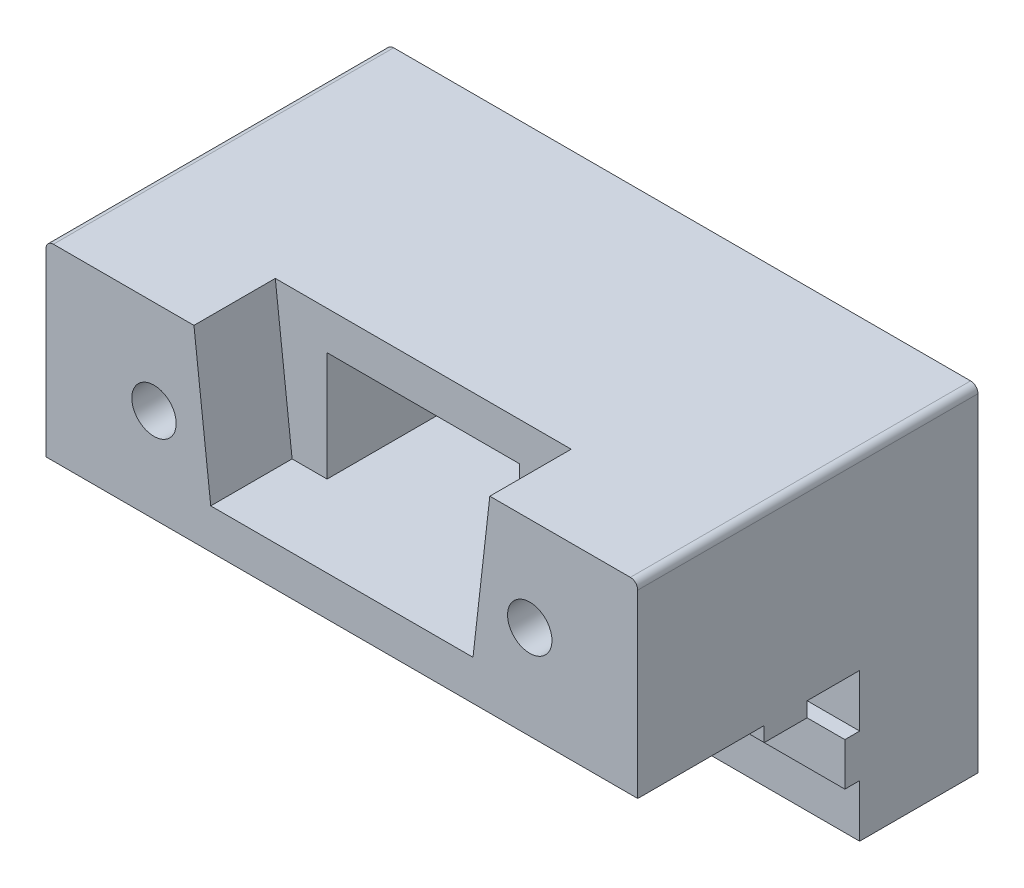
ISO-10303-21;
HEADER;
FILE_DESCRIPTION(('STEP AP214'),'2;1');
FILE_NAME('part.step','',(''),(''),'','','');
FILE_SCHEMA(('AUTOMOTIVE_DESIGN { 1 0 10303 214 1 1 1 1 }'));
ENDSEC;
DATA;
#1=APPLICATION_CONTEXT('core data for automotive mechanical design processes');
#2=APPLICATION_PROTOCOL_DEFINITION('international standard','automotive_design',2000,#1);
#3=PRODUCT_CONTEXT('',#1,'mechanical');
#4=PRODUCT('Part','Part','',(#3));
#5=PRODUCT_RELATED_PRODUCT_CATEGORY('part','',(#4));
#6=PRODUCT_DEFINITION_FORMATION('','',#4);
#7=PRODUCT_DEFINITION_CONTEXT('part definition',#1,'design');
#8=PRODUCT_DEFINITION('design','',#6,#7);
#9=PRODUCT_DEFINITION_SHAPE('','',#8);
#10=(LENGTH_UNIT() NAMED_UNIT(*) SI_UNIT(.MILLI.,.METRE.));
#11=(NAMED_UNIT(*) PLANE_ANGLE_UNIT() SI_UNIT($,.RADIAN.));
#12=(NAMED_UNIT(*) SI_UNIT($,.STERADIAN.) SOLID_ANGLE_UNIT());
#13=UNCERTAINTY_MEASURE_WITH_UNIT(LENGTH_MEASURE(1.E-05),#10,'distance_accuracy_value','');
#14=(GEOMETRIC_REPRESENTATION_CONTEXT(3) GLOBAL_UNCERTAINTY_ASSIGNED_CONTEXT((#13)) GLOBAL_UNIT_ASSIGNED_CONTEXT((#10,
#11,#12)) REPRESENTATION_CONTEXT('',''));
#15=CARTESIAN_POINT('',(0.,0.,0.));
#16=DIRECTION('',(0.,0.,1.));
#17=DIRECTION('',(1.,0.,0.));
#18=AXIS2_PLACEMENT_3D('',#15,#16,#17);
#19=CARTESIAN_POINT('',(46.2733705489037,-9.9,8.));
#20=DIRECTION('',(0.,1.,0.));
#21=DIRECTION('',(0.,0.,1.));
#22=AXIS2_PLACEMENT_3D('',#19,#20,#21);
#23=PLANE('',#22);
#24=DIRECTION('',(0.,0.,-1.));
#25=VECTOR('',#24,1.);
#26=CARTESIAN_POINT('',(0.384057287393444,-9.9,23.));
#27=LINE('',#26,#25);
#28=CARTESIAN_POINT('',(0.384057287393444,-9.9,9.));
#29=VERTEX_POINT('',#28);
#30=CARTESIAN_POINT('',(0.384057287393444,-9.9,8.));
#31=VERTEX_POINT('',#30);
#32=EDGE_CURVE('E240',#29,#31,#27,.T.);
#33=ORIENTED_EDGE('',*,*,#32,.F.);
#34=DIRECTION('',(-1.,0.,0.));
#35=VECTOR('',#34,1.);
#36=CARTESIAN_POINT('',(46.2733705489037,-9.9,9.));
#37=LINE('',#36,#35);
#38=CARTESIAN_POINT('',(20.,-9.9,9.));
#39=VERTEX_POINT('',#38);
#40=EDGE_CURVE('E239',#39,#29,#37,.T.);
#41=ORIENTED_EDGE('',*,*,#40,.F.);
#42=DIRECTION('',(0.,0.,1.));
#43=VECTOR('',#42,1.);
#44=CARTESIAN_POINT('',(20.,-9.9,8.));
#45=LINE('',#44,#43);
#46=CARTESIAN_POINT('',(20.,-9.9,8.));
#47=VERTEX_POINT('',#46);
#48=EDGE_CURVE('E378',#47,#39,#45,.T.);
#49=ORIENTED_EDGE('',*,*,#48,.F.);
#50=DIRECTION('',(-1.,0.,0.));
#51=VECTOR('',#50,1.);
#52=CARTESIAN_POINT('',(46.2733705489037,-9.9,8.));
#53=LINE('',#52,#51);
#54=EDGE_CURVE('E433',#47,#31,#53,.T.);
#55=ORIENTED_EDGE('',*,*,#54,.T.);
#56=EDGE_LOOP('',(#33,#41,#49,#55));
#57=FACE_BOUND('',#56,.T.);
#58=ADVANCED_FACE('F34',(#57),#23,.T.);
#59=CARTESIAN_POINT('',(46.2733705489037,-9.9,9.));
#60=DIRECTION('',(0.,0.,1.));
#61=DIRECTION('',(1.,0.,0.));
#62=AXIS2_PLACEMENT_3D('',#59,#60,#61);
#63=PLANE('',#62);
#64=CARTESIAN_POINT('',(0.,-11.35,9.));
#65=DIRECTION('',(0.,0.,1.));
#66=DIRECTION('',(1.,0.,0.));
#67=AXIS2_PLACEMENT_3D('',#64,#65,#66);
#68=CIRCLE('',#67,1.5);
#69=CARTESIAN_POINT('',(-0.384057287393444,-9.9,9.));
#70=VERTEX_POINT('',#69);
#71=CARTESIAN_POINT('',(-0.384057287393418,-12.8,9.));
#72=VERTEX_POINT('',#71);
#73=EDGE_CURVE('E242',#70,#72,#68,.T.);
#74=ORIENTED_EDGE('',*,*,#73,.F.);
#75=CARTESIAN_POINT('',(-20.,-9.9,9.));
#76=VERTEX_POINT('',#75);
#77=EDGE_CURVE('E245',#70,#76,#37,.T.);
#78=ORIENTED_EDGE('',*,*,#77,.T.);
#79=DIRECTION('',(0.,1.,0.));
#80=VECTOR('',#79,1.);
#81=CARTESIAN_POINT('',(-20.,-9.9,9.));
#82=LINE('',#81,#80);
#83=CARTESIAN_POINT('',(-20.,-12.8,9.));
#84=VERTEX_POINT('',#83);
#85=EDGE_CURVE('E395',#84,#76,#82,.T.);
#86=ORIENTED_EDGE('',*,*,#85,.F.);
#87=DIRECTION('',(-1.,0.,0.));
#88=VECTOR('',#87,1.);
#89=CARTESIAN_POINT('',(46.2733705489037,-12.8,9.));
#90=LINE('',#89,#88);
#91=EDGE_CURVE('E246',#72,#84,#90,.T.);
#92=ORIENTED_EDGE('',*,*,#91,.F.);
#93=EDGE_LOOP('',(#74,#78,#86,#92));
#94=FACE_BOUND('',#93,.T.);
#95=ADVANCED_FACE('F460',(#94),#63,.T.);
#96=CARTESIAN_POINT('',(46.2733705489037,-12.8,9.));
#97=DIRECTION('',(0.,-1.,0.));
#98=DIRECTION('',(0.,0.,-1.));
#99=AXIS2_PLACEMENT_3D('',#96,#97,#98);
#100=PLANE('',#99);
#101=DIRECTION('',(0.,0.,-1.));
#102=VECTOR('',#101,1.);
#103=CARTESIAN_POINT('',(-0.384057287393418,-12.8,23.));
#104=LINE('',#103,#102);
#105=CARTESIAN_POINT('',(-0.384057287393418,-12.8,8.));
#106=VERTEX_POINT('',#105);
#107=EDGE_CURVE('E462',#72,#106,#104,.T.);
#108=ORIENTED_EDGE('',*,*,#107,.F.);
#109=ORIENTED_EDGE('',*,*,#91,.T.);
#110=DIRECTION('',(0.,0.,1.));
#111=VECTOR('',#110,1.);
#112=CARTESIAN_POINT('',(-20.,-12.8,9.));
#113=LINE('',#112,#111);
#114=CARTESIAN_POINT('',(-20.,-12.8,8.));
#115=VERTEX_POINT('',#114);
#116=EDGE_CURVE('E363',#115,#84,#113,.T.);
#117=ORIENTED_EDGE('',*,*,#116,.F.);
#118=DIRECTION('',(-1.,0.,0.));
#119=VECTOR('',#118,1.);
#120=CARTESIAN_POINT('',(46.2733705489037,-12.8,8.));
#121=LINE('',#120,#119);
#122=EDGE_CURVE('E253',#106,#115,#121,.T.);
#123=ORIENTED_EDGE('',*,*,#122,.F.);
#124=EDGE_LOOP('',(#108,#109,#117,#123));
#125=FACE_BOUND('',#124,.T.);
#126=ADVANCED_FACE('F553',(#125),#100,.T.);
#127=CARTESIAN_POINT('',(-12.7,0.,0.));
#128=DIRECTION('',(0.,0.,1.));
#129=DIRECTION('',(1.,0.,0.));
#130=AXIS2_PLACEMENT_3D('',#127,#128,#129);
#131=CYLINDRICAL_SURFACE('',#130,1.5);
#132=CARTESIAN_POINT('',(-12.7,0.,23.));
#133=DIRECTION('',(0.,0.,1.));
#134=DIRECTION('',(1.,0.,0.));
#135=AXIS2_PLACEMENT_3D('',#132,#133,#134);
#136=CIRCLE('',#135,1.5);
#137=CARTESIAN_POINT('',(-11.2,0.,23.));
#138=VERTEX_POINT('',#137);
#139=EDGE_CURVE('E307',#138,#138,#136,.T.);
#140=ORIENTED_EDGE('',*,*,#139,.T.);
#141=EDGE_LOOP('',(#140));
#142=FACE_BOUND('',#141,.T.);
#143=CARTESIAN_POINT('',(-12.7,0.,13.));
#144=DIRECTION('',(0.,0.,-1.));
#145=DIRECTION('',(-1.,0.,0.));
#146=AXIS2_PLACEMENT_3D('',#143,#144,#145);
#147=CIRCLE('',#146,1.5);
#148=CARTESIAN_POINT('',(-14.2,0.,13.));
#149=VERTEX_POINT('',#148);
#150=EDGE_CURVE('E38',#149,#149,#147,.F.);
#151=ORIENTED_EDGE('',*,*,#150,.F.);
#152=EDGE_LOOP('',(#151));
#153=FACE_BOUND('',#152,.T.);
#154=ADVANCED_FACE('F666',(#142,#153),#131,.F.);
#155=CARTESIAN_POINT('',(12.7,0.,0.));
#156=DIRECTION('',(0.,0.,1.));
#157=DIRECTION('',(1.,0.,0.));
#158=AXIS2_PLACEMENT_3D('',#155,#156,#157);
#159=CYLINDRICAL_SURFACE('',#158,1.5);
#160=CARTESIAN_POINT('',(12.7,0.,23.));
#161=DIRECTION('',(0.,0.,1.));
#162=DIRECTION('',(1.,0.,0.));
#163=AXIS2_PLACEMENT_3D('',#160,#161,#162);
#164=CIRCLE('',#163,1.5);
#165=CARTESIAN_POINT('',(14.2,0.,23.));
#166=VERTEX_POINT('',#165);
#167=EDGE_CURVE('E294',#166,#166,#164,.T.);
#168=ORIENTED_EDGE('',*,*,#167,.T.);
#169=EDGE_LOOP('',(#168));
#170=FACE_BOUND('',#169,.T.);
#171=CARTESIAN_POINT('',(12.7,0.,13.));
#172=DIRECTION('',(0.,0.,-1.));
#173=DIRECTION('',(-1.,0.,0.));
#174=AXIS2_PLACEMENT_3D('',#171,#172,#173);
#175=CIRCLE('',#174,1.5);
#176=CARTESIAN_POINT('',(11.2,0.,13.));
#177=VERTEX_POINT('',#176);
#178=EDGE_CURVE('E356',#177,#177,#175,.F.);
#179=ORIENTED_EDGE('',*,*,#178,.F.);
#180=EDGE_LOOP('',(#179));
#181=FACE_BOUND('',#180,.T.);
#182=ADVANCED_FACE('F686',(#170,#181),#159,.F.);
#183=CARTESIAN_POINT('',(-20.,-6.35,23.));
#184=DIRECTION('',(0.,1.,0.));
#185=DIRECTION('',(-1.,0.,0.));
#186=AXIS2_PLACEMENT_3D('',#183,#184,#185);
#187=PLANE('',#186);
#188=DIRECTION('',(0.,0.,-1.));
#189=VECTOR('',#188,1.);
#190=CARTESIAN_POINT('',(-20.,-6.35,23.));
#191=LINE('',#190,#189);
#192=CARTESIAN_POINT('',(-20.,-6.35,23.));
#193=VERTEX_POINT('',#192);
#194=CARTESIAN_POINT('',(-20.,-6.35,14.45));
#195=VERTEX_POINT('',#194);
#196=EDGE_CURVE('E332',#193,#195,#191,.T.);
#197=ORIENTED_EDGE('',*,*,#196,.T.);
#198=DIRECTION('',(-1.,0.,0.));
#199=VECTOR('',#198,1.);
#200=CARTESIAN_POINT('',(46.2733705489037,-6.35,14.45));
#201=LINE('',#200,#199);
#202=CARTESIAN_POINT('',(20.,-6.35,14.45));
#203=VERTEX_POINT('',#202);
#204=EDGE_CURVE('E425',#203,#195,#201,.T.);
#205=ORIENTED_EDGE('',*,*,#204,.F.);
#206=DIRECTION('',(0.,0.,-1.));
#207=VECTOR('',#206,1.);
#208=CARTESIAN_POINT('',(20.,-6.35,23.));
#209=LINE('',#208,#207);
#210=CARTESIAN_POINT('',(20.,-6.35,23.));
#211=VERTEX_POINT('',#210);
#212=EDGE_CURVE('E328',#211,#203,#209,.T.);
#213=ORIENTED_EDGE('',*,*,#212,.F.);
#214=DIRECTION('',(1.,0.,0.));
#215=VECTOR('',#214,1.);
#216=CARTESIAN_POINT('',(-20.,-6.35,23.));
#217=LINE('',#216,#215);
#218=EDGE_CURVE('E313',#193,#211,#217,.T.);
#219=ORIENTED_EDGE('',*,*,#218,.F.);
#220=EDGE_LOOP('',(#197,#205,#213,#219));
#221=FACE_BOUND('',#220,.T.);
#222=ADVANCED_FACE('F533',(#221),#187,.F.);
#223=CARTESIAN_POINT('',(20.,-6.35,11.55));
#224=VERTEX_POINT('',#223);
#225=CARTESIAN_POINT('',(20.,-6.35,8.));
#226=VERTEX_POINT('',#225);
#227=EDGE_CURVE('E322',#224,#226,#209,.T.);
#228=ORIENTED_EDGE('',*,*,#227,.F.);
#229=DIRECTION('',(-1.,0.,0.));
#230=VECTOR('',#229,1.);
#231=CARTESIAN_POINT('',(46.2733705489037,-6.35,11.55));
#232=LINE('',#231,#230);
#233=CARTESIAN_POINT('',(-20.,-6.35,11.55));
#234=VERTEX_POINT('',#233);
#235=EDGE_CURVE('E59',#224,#234,#232,.T.);
#236=ORIENTED_EDGE('',*,*,#235,.T.);
#237=CARTESIAN_POINT('',(-20.,-6.35,8.));
#238=VERTEX_POINT('',#237);
#239=EDGE_CURVE('E331',#234,#238,#191,.T.);
#240=ORIENTED_EDGE('',*,*,#239,.T.);
#241=DIRECTION('',(-1.,0.,0.));
#242=VECTOR('',#241,1.);
#243=CARTESIAN_POINT('',(46.2733705489037,-6.35,8.));
#244=LINE('',#243,#242);
#245=EDGE_CURVE('E432',#226,#238,#244,.T.);
#246=ORIENTED_EDGE('',*,*,#245,.F.);
#247=EDGE_LOOP('',(#228,#236,#240,#246));
#248=FACE_BOUND('',#247,.T.);
#249=ADVANCED_FACE('F546',(#248),#187,.F.);
#250=CARTESIAN_POINT('',(-20.,6.35,23.));
#251=DIRECTION('',(0.,-1.,0.));
#252=DIRECTION('',(1.,0.,0.));
#253=AXIS2_PLACEMENT_3D('',#250,#251,#252);
#254=PLANE('',#253);
#255=DIRECTION('',(0.,0.,1.));
#256=VECTOR('',#255,1.);
#257=CARTESIAN_POINT('',(-10.,6.35,-6.46330528120025));
#258=LINE('',#257,#256);
#259=CARTESIAN_POINT('',(-10.,6.35,17.5));
#260=VERTEX_POINT('',#259);
#261=CARTESIAN_POINT('',(-10.,6.35,23.));
#262=VERTEX_POINT('',#261);
#263=EDGE_CURVE('E300',#260,#262,#258,.T.);
#264=ORIENTED_EDGE('',*,*,#263,.F.);
#265=DIRECTION('',(-1.,0.,0.));
#266=VECTOR('',#265,1.);
#267=CARTESIAN_POINT('',(10.,6.35,17.5));
#268=LINE('',#267,#266);
#269=CARTESIAN_POINT('',(10.,6.35,17.5));
#270=VERTEX_POINT('',#269);
#271=EDGE_CURVE('E292',#270,#260,#268,.T.);
#272=ORIENTED_EDGE('',*,*,#271,.F.);
#273=DIRECTION('',(0.,0.,1.));
#274=VECTOR('',#273,1.);
#275=CARTESIAN_POINT('',(10.,6.35,-6.46330528120025));
#276=LINE('',#275,#274);
#277=CARTESIAN_POINT('',(10.,6.35,23.));
#278=VERTEX_POINT('',#277);
#279=EDGE_CURVE('E297',#270,#278,#276,.T.);
#280=ORIENTED_EDGE('',*,*,#279,.T.);
#281=DIRECTION('',(-1.,0.,0.));
#282=VECTOR('',#281,1.);
#283=CARTESIAN_POINT('',(-20.,6.35,23.));
#284=LINE('',#283,#282);
#285=CARTESIAN_POINT('',(19.5,6.35,23.));
#286=VERTEX_POINT('',#285);
#287=EDGE_CURVE('E319',#286,#278,#284,.T.);
#288=ORIENTED_EDGE('',*,*,#287,.F.);
#289=DIRECTION('',(0.,0.,-1.));
#290=VECTOR('',#289,1.);
#291=CARTESIAN_POINT('',(19.5,6.35,23.));
#292=LINE('',#291,#290);
#293=CARTESIAN_POINT('',(19.5,6.35,0.));
#294=VERTEX_POINT('',#293);
#295=EDGE_CURVE('E338',#286,#294,#292,.T.);
#296=ORIENTED_EDGE('',*,*,#295,.T.);
#297=DIRECTION('',(-1.,0.,0.));
#298=VECTOR('',#297,1.);
#299=CARTESIAN_POINT('',(-20.,6.35,0.));
#300=LINE('',#299,#298);
#301=CARTESIAN_POINT('',(-19.5,6.35,0.));
#302=VERTEX_POINT('',#301);
#303=EDGE_CURVE('E314',#294,#302,#300,.T.);
#304=ORIENTED_EDGE('',*,*,#303,.T.);
#305=DIRECTION('',(0.,0.,-1.));
#306=VECTOR('',#305,1.);
#307=CARTESIAN_POINT('',(-19.5,6.35,23.));
#308=LINE('',#307,#306);
#309=CARTESIAN_POINT('',(-19.5,6.35,23.));
#310=VERTEX_POINT('',#309);
#311=EDGE_CURVE('E335',#302,#310,#308,.F.);
#312=ORIENTED_EDGE('',*,*,#311,.T.);
#313=EDGE_CURVE('E318',#262,#310,#284,.T.);
#314=ORIENTED_EDGE('',*,*,#313,.F.);
#315=EDGE_LOOP('',(#264,#272,#280,#288,#296,#304,#312,#314));
#316=FACE_BOUND('',#315,.T.);
#317=ADVANCED_FACE('F522',(#316),#254,.F.);
#318=CARTESIAN_POINT('',(0.,0.,23.));
#319=DIRECTION('',(0.,0.,1.));
#320=DIRECTION('',(1.,0.,0.));
#321=AXIS2_PLACEMENT_3D('',#318,#319,#320);
#322=PLANE('',#321);
#323=DIRECTION('',(-0.112909688044286,-0.993605254789719,0.));
#324=VECTOR('',#323,1.);
#325=CARTESIAN_POINT('',(8.5,-6.85,23.));
#326=LINE('',#325,#324);
#327=CARTESIAN_POINT('',(8.86363636363637,-3.65,23.));
#328=VERTEX_POINT('',#327);
#329=EDGE_CURVE('E285',#278,#328,#326,.T.);
#330=ORIENTED_EDGE('',*,*,#329,.T.);
#331=DIRECTION('',(-1.,0.,0.));
#332=VECTOR('',#331,1.);
#333=CARTESIAN_POINT('',(46.2733705489037,-3.65,23.));
#334=LINE('',#333,#332);
#335=CARTESIAN_POINT('',(-8.86363636363635,-3.65,23.));
#336=VERTEX_POINT('',#335);
#337=EDGE_CURVE('E422',#328,#336,#334,.T.);
#338=ORIENTED_EDGE('',*,*,#337,.T.);
#339=DIRECTION('',(-0.112909688044286,0.993605254789719,0.));
#340=VECTOR('',#339,1.);
#341=CARTESIAN_POINT('',(-9.16012238653748,-1.04092299847017,23.));
#342=LINE('',#341,#340);
#343=EDGE_CURVE('E43',#336,#262,#342,.T.);
#344=ORIENTED_EDGE('',*,*,#343,.T.);
#345=ORIENTED_EDGE('',*,*,#313,.T.);
#346=CARTESIAN_POINT('',(-19.5,5.85,23.));
#347=DIRECTION('',(0.,0.,1.));
#348=DIRECTION('',(1.,0.,0.));
#349=AXIS2_PLACEMENT_3D('',#346,#347,#348);
#350=CIRCLE('',#349,0.5);
#351=CARTESIAN_POINT('',(-20.,5.85,23.));
#352=VERTEX_POINT('',#351);
#353=EDGE_CURVE('E349',#310,#352,#350,.T.);
#354=ORIENTED_EDGE('',*,*,#353,.T.);
#355=DIRECTION('',(0.,-1.,0.));
#356=VECTOR('',#355,1.);
#357=CARTESIAN_POINT('',(-20.,6.35,23.));
#358=LINE('',#357,#356);
#359=EDGE_CURVE('E311',#352,#193,#358,.T.);
#360=ORIENTED_EDGE('',*,*,#359,.T.);
#361=ORIENTED_EDGE('',*,*,#218,.T.);
#362=DIRECTION('',(0.,1.,0.));
#363=VECTOR('',#362,1.);
#364=CARTESIAN_POINT('',(20.,6.35,23.));
#365=LINE('',#364,#363);
#366=CARTESIAN_POINT('',(20.,5.85,23.));
#367=VERTEX_POINT('',#366);
#368=EDGE_CURVE('E316',#211,#367,#365,.T.);
#369=ORIENTED_EDGE('',*,*,#368,.T.);
#370=CARTESIAN_POINT('',(19.5,5.85,23.));
#371=DIRECTION('',(0.,0.,1.));
#372=DIRECTION('',(1.,0.,0.));
#373=AXIS2_PLACEMENT_3D('',#370,#371,#372);
#374=CIRCLE('',#373,0.5);
#375=EDGE_CURVE('E351',#367,#286,#374,.T.);
#376=ORIENTED_EDGE('',*,*,#375,.T.);
#377=ORIENTED_EDGE('',*,*,#287,.T.);
#378=EDGE_LOOP('',(#330,#338,#344,#345,#354,#360,#361,#369,#376,#377));
#379=FACE_BOUND('',#378,.T.);
#380=ORIENTED_EDGE('',*,*,#167,.F.);
#381=EDGE_LOOP('',(#380));
#382=FACE_BOUND('',#381,.T.);
#383=ORIENTED_EDGE('',*,*,#139,.F.);
#384=EDGE_LOOP('',(#383));
#385=FACE_BOUND('',#384,.T.);
#386=ADVANCED_FACE('F527',(#379,#382,#385),#322,.T.);
#387=CARTESIAN_POINT('',(-20.,6.35,23.));
#388=DIRECTION('',(1.,0.,0.));
#389=DIRECTION('',(0.,0.,-1.));
#390=AXIS2_PLACEMENT_3D('',#387,#388,#389);
#391=PLANE('',#390);
#392=DIRECTION('',(0.,-1.,0.));
#393=VECTOR('',#392,1.);
#394=CARTESIAN_POINT('',(-20.,6.35,0.));
#395=LINE('',#394,#393);
#396=CARTESIAN_POINT('',(-20.,5.85,0.));
#397=VERTEX_POINT('',#396);
#398=CARTESIAN_POINT('',(-20.,-16.35,0.));
#399=VERTEX_POINT('',#398);
#400=EDGE_CURVE('E310',#397,#399,#395,.T.);
#401=ORIENTED_EDGE('',*,*,#400,.T.);
#402=DIRECTION('',(0.,0.,1.));
#403=VECTOR('',#402,1.);
#404=CARTESIAN_POINT('',(-20.,-16.35,8.));
#405=LINE('',#404,#403);
#406=CARTESIAN_POINT('',(-20.,-16.35,8.));
#407=VERTEX_POINT('',#406);
#408=EDGE_CURVE('E413',#399,#407,#405,.T.);
#409=ORIENTED_EDGE('',*,*,#408,.T.);
#410=DIRECTION('',(0.,1.,0.));
#411=VECTOR('',#410,1.);
#412=CARTESIAN_POINT('',(-20.,-12.8,8.));
#413=LINE('',#412,#411);
#414=EDGE_CURVE('E358',#407,#115,#413,.T.);
#415=ORIENTED_EDGE('',*,*,#414,.T.);
#416=ORIENTED_EDGE('',*,*,#116,.T.);
#417=ORIENTED_EDGE('',*,*,#85,.T.);
#418=DIRECTION('',(0.,0.,-1.));
#419=VECTOR('',#418,1.);
#420=CARTESIAN_POINT('',(-20.,-9.9,8.));
#421=LINE('',#420,#419);
#422=CARTESIAN_POINT('',(-20.,-9.9,8.));
#423=VERTEX_POINT('',#422);
#424=EDGE_CURVE('E398',#76,#423,#421,.T.);
#425=ORIENTED_EDGE('',*,*,#424,.T.);
#426=DIRECTION('',(0.,1.,0.));
#427=VECTOR('',#426,1.);
#428=CARTESIAN_POINT('',(-20.,-6.35,8.));
#429=LINE('',#428,#427);
#430=EDGE_CURVE('E401',#423,#238,#429,.T.);
#431=ORIENTED_EDGE('',*,*,#430,.T.);
#432=ORIENTED_EDGE('',*,*,#239,.F.);
#433=DIRECTION('',(0.,-1.,0.));
#434=VECTOR('',#433,1.);
#435=CARTESIAN_POINT('',(-20.,-7.35,11.55));
#436=LINE('',#435,#434);
#437=CARTESIAN_POINT('',(-20.,-7.35,11.55));
#438=VERTEX_POINT('',#437);
#439=EDGE_CURVE('E404',#234,#438,#436,.T.);
#440=ORIENTED_EDGE('',*,*,#439,.T.);
#441=DIRECTION('',(0.,0.,1.));
#442=VECTOR('',#441,1.);
#443=CARTESIAN_POINT('',(-20.,-7.35,14.45));
#444=LINE('',#443,#442);
#445=CARTESIAN_POINT('',(-20.,-7.35,14.45));
#446=VERTEX_POINT('',#445);
#447=EDGE_CURVE('E407',#438,#446,#444,.T.);
#448=ORIENTED_EDGE('',*,*,#447,.T.);
#449=DIRECTION('',(0.,1.,0.));
#450=VECTOR('',#449,1.);
#451=CARTESIAN_POINT('',(-20.,-6.35,14.45));
#452=LINE('',#451,#450);
#453=EDGE_CURVE('E410',#446,#195,#452,.T.);
#454=ORIENTED_EDGE('',*,*,#453,.T.);
#455=ORIENTED_EDGE('',*,*,#196,.F.);
#456=ORIENTED_EDGE('',*,*,#359,.F.);
#457=DIRECTION('',(0.,0.,-1.));
#458=VECTOR('',#457,1.);
#459=CARTESIAN_POINT('',(-20.,5.85,23.));
#460=LINE('',#459,#458);
#461=EDGE_CURVE('E353',#352,#397,#460,.T.);
#462=ORIENTED_EDGE('',*,*,#461,.T.);
#463=EDGE_LOOP('',(#401,#409,#415,#416,#417,#425,#431,#432,#440,#448,#454,#455,#456,#462));
#464=FACE_BOUND('',#463,.T.);
#465=ADVANCED_FACE('F454',(#464),#391,.F.);
#466=CARTESIAN_POINT('',(20.,6.35,23.));
#467=DIRECTION('',(-1.,0.,0.));
#468=DIRECTION('',(0.,0.,1.));
#469=AXIS2_PLACEMENT_3D('',#466,#467,#468);
#470=PLANE('',#469);
#471=DIRECTION('',(0.,0.,-1.));
#472=VECTOR('',#471,1.);
#473=CARTESIAN_POINT('',(20.,5.85,23.));
#474=LINE('',#473,#472);
#475=CARTESIAN_POINT('',(20.,5.85,0.));
#476=VERTEX_POINT('',#475);
#477=EDGE_CURVE('E346',#476,#367,#474,.F.);
#478=ORIENTED_EDGE('',*,*,#477,.T.);
#479=ORIENTED_EDGE('',*,*,#368,.F.);
#480=ORIENTED_EDGE('',*,*,#212,.T.);
#481=DIRECTION('',(0.,-1.,0.));
#482=VECTOR('',#481,1.);
#483=CARTESIAN_POINT('',(20.,-6.35,14.45));
#484=LINE('',#483,#482);
#485=CARTESIAN_POINT('',(20.,-7.35,14.45));
#486=VERTEX_POINT('',#485);
#487=EDGE_CURVE('E387',#203,#486,#484,.T.);
#488=ORIENTED_EDGE('',*,*,#487,.T.);
#489=DIRECTION('',(0.,0.,-1.));
#490=VECTOR('',#489,1.);
#491=CARTESIAN_POINT('',(20.,-7.35,14.45));
#492=LINE('',#491,#490);
#493=CARTESIAN_POINT('',(20.,-7.35,11.55));
#494=VERTEX_POINT('',#493);
#495=EDGE_CURVE('E385',#486,#494,#492,.T.);
#496=ORIENTED_EDGE('',*,*,#495,.T.);
#497=DIRECTION('',(0.,1.,0.));
#498=VECTOR('',#497,1.);
#499=CARTESIAN_POINT('',(20.,-7.35,11.55));
#500=LINE('',#499,#498);
#501=EDGE_CURVE('E383',#494,#224,#500,.T.);
#502=ORIENTED_EDGE('',*,*,#501,.T.);
#503=ORIENTED_EDGE('',*,*,#227,.T.);
#504=DIRECTION('',(0.,-1.,0.));
#505=VECTOR('',#504,1.);
#506=CARTESIAN_POINT('',(20.,-6.35,8.));
#507=LINE('',#506,#505);
#508=EDGE_CURVE('E381',#226,#47,#507,.T.);
#509=ORIENTED_EDGE('',*,*,#508,.T.);
#510=ORIENTED_EDGE('',*,*,#48,.T.);
#511=DIRECTION('',(0.,-1.,0.));
#512=VECTOR('',#511,1.);
#513=CARTESIAN_POINT('',(20.,-9.9,9.));
#514=LINE('',#513,#512);
#515=CARTESIAN_POINT('',(20.,-12.8,9.));
#516=VERTEX_POINT('',#515);
#517=EDGE_CURVE('E376',#39,#516,#514,.T.);
#518=ORIENTED_EDGE('',*,*,#517,.T.);
#519=DIRECTION('',(0.,0.,-1.));
#520=VECTOR('',#519,1.);
#521=CARTESIAN_POINT('',(20.,-12.8,9.));
#522=LINE('',#521,#520);
#523=CARTESIAN_POINT('',(20.,-12.8,8.));
#524=VERTEX_POINT('',#523);
#525=EDGE_CURVE('E244',#516,#524,#522,.T.);
#526=ORIENTED_EDGE('',*,*,#525,.T.);
#527=DIRECTION('',(0.,-1.,0.));
#528=VECTOR('',#527,1.);
#529=CARTESIAN_POINT('',(20.,-12.8,8.));
#530=LINE('',#529,#528);
#531=CARTESIAN_POINT('',(20.,-16.35,8.));
#532=VERTEX_POINT('',#531);
#533=EDGE_CURVE('E256',#524,#532,#530,.T.);
#534=ORIENTED_EDGE('',*,*,#533,.T.);
#535=DIRECTION('',(0.,0.,-1.));
#536=VECTOR('',#535,1.);
#537=CARTESIAN_POINT('',(20.,-16.35,8.));
#538=LINE('',#537,#536);
#539=CARTESIAN_POINT('',(20.,-16.35,0.));
#540=VERTEX_POINT('',#539);
#541=EDGE_CURVE('E389',#532,#540,#538,.T.);
#542=ORIENTED_EDGE('',*,*,#541,.T.);
#543=DIRECTION('',(0.,1.,0.));
#544=VECTOR('',#543,1.);
#545=CARTESIAN_POINT('',(20.,6.35,0.));
#546=LINE('',#545,#544);
#547=EDGE_CURVE('E324',#540,#476,#546,.T.);
#548=ORIENTED_EDGE('',*,*,#547,.T.);
#549=EDGE_LOOP('',(#478,#479,#480,#488,#496,#502,#503,#509,#510,#518,#526,#534,#542,#548));
#550=FACE_BOUND('',#549,.T.);
#551=ADVANCED_FACE('F490',(#550),#470,.F.);
#552=CARTESIAN_POINT('',(0.,0.,0.));
#553=DIRECTION('',(0.,0.,1.));
#554=DIRECTION('',(1.,0.,0.));
#555=AXIS2_PLACEMENT_3D('',#552,#553,#554);
#556=PLANE('',#555);
#557=CARTESIAN_POINT('',(0.,-11.35,0.));
#558=DIRECTION('',(0.,0.,-1.));
#559=DIRECTION('',(-1.,0.,0.));
#560=AXIS2_PLACEMENT_3D('',#557,#558,#559);
#561=CIRCLE('',#560,4.);
#562=CARTESIAN_POINT('',(-4.,-11.35,0.));
#563=VERTEX_POINT('',#562);
#564=EDGE_CURVE('E463',#563,#563,#561,.T.);
#565=ORIENTED_EDGE('',*,*,#564,.F.);
#566=EDGE_LOOP('',(#565));
#567=FACE_BOUND('',#566,.T.);
#568=CARTESIAN_POINT('',(-12.7,0.,0.));
#569=DIRECTION('',(0.,0.,-1.));
#570=DIRECTION('',(-1.,0.,0.));
#571=AXIS2_PLACEMENT_3D('',#568,#569,#570);
#572=CIRCLE('',#571,4.);
#573=CARTESIAN_POINT('',(-16.7,0.,0.));
#574=VERTEX_POINT('',#573);
#575=EDGE_CURVE('E373',#574,#574,#572,.T.);
#576=ORIENTED_EDGE('',*,*,#575,.F.);
#577=EDGE_LOOP('',(#576));
#578=FACE_BOUND('',#577,.T.);
#579=CARTESIAN_POINT('',(12.7,0.,0.));
#580=DIRECTION('',(0.,0.,-1.));
#581=DIRECTION('',(-1.,0.,0.));
#582=AXIS2_PLACEMENT_3D('',#579,#580,#581);
#583=CIRCLE('',#582,4.);
#584=CARTESIAN_POINT('',(8.7,0.,0.));
#585=VERTEX_POINT('',#584);
#586=EDGE_CURVE('E366',#585,#585,#583,.T.);
#587=ORIENTED_EDGE('',*,*,#586,.F.);
#588=EDGE_LOOP('',(#587));
#589=FACE_BOUND('',#588,.T.);
#590=DIRECTION('',(-1.,0.,0.));
#591=VECTOR('',#590,1.);
#592=CARTESIAN_POINT('',(46.2733705489037,-3.65,0.));
#593=LINE('',#592,#591);
#594=CARTESIAN_POINT('',(6.5,-3.65,0.));
#595=VERTEX_POINT('',#594);
#596=CARTESIAN_POINT('',(-6.5,-3.65,0.));
#597=VERTEX_POINT('',#596);
#598=EDGE_CURVE('E420',#595,#597,#593,.T.);
#599=ORIENTED_EDGE('',*,*,#598,.F.);
#600=DIRECTION('',(0.,1.,0.));
#601=VECTOR('',#600,1.);
#602=CARTESIAN_POINT('',(6.5,3.75,0.));
#603=LINE('',#602,#601);
#604=CARTESIAN_POINT('',(6.5,3.75,0.));
#605=VERTEX_POINT('',#604);
#606=EDGE_CURVE('E270',#595,#605,#603,.T.);
#607=ORIENTED_EDGE('',*,*,#606,.T.);
#608=DIRECTION('',(-1.,0.,0.));
#609=VECTOR('',#608,1.);
#610=CARTESIAN_POINT('',(-6.5,3.75,0.));
#611=LINE('',#610,#609);
#612=CARTESIAN_POINT('',(-6.5,3.75,0.));
#613=VERTEX_POINT('',#612);
#614=EDGE_CURVE('E273',#605,#613,#611,.T.);
#615=ORIENTED_EDGE('',*,*,#614,.T.);
#616=DIRECTION('',(0.,-1.,0.));
#617=VECTOR('',#616,1.);
#618=CARTESIAN_POINT('',(-6.5,3.75,0.));
#619=LINE('',#618,#617);
#620=EDGE_CURVE('E267',#613,#597,#619,.T.);
#621=ORIENTED_EDGE('',*,*,#620,.T.);
#622=EDGE_LOOP('',(#599,#607,#615,#621));
#623=FACE_BOUND('',#622,.T.);
#624=CARTESIAN_POINT('',(19.5,5.85,0.));
#625=DIRECTION('',(0.,0.,1.));
#626=DIRECTION('',(1.,0.,0.));
#627=AXIS2_PLACEMENT_3D('',#624,#625,#626);
#628=CIRCLE('',#627,0.5);
#629=EDGE_CURVE('E343',#294,#476,#628,.F.);
#630=ORIENTED_EDGE('',*,*,#629,.T.);
#631=ORIENTED_EDGE('',*,*,#547,.F.);
#632=DIRECTION('',(-1.,0.,0.));
#633=VECTOR('',#632,1.);
#634=CARTESIAN_POINT('',(46.2733705489037,-16.35,0.));
#635=LINE('',#634,#633);
#636=EDGE_CURVE('E417',#540,#399,#635,.T.);
#637=ORIENTED_EDGE('',*,*,#636,.T.);
#638=ORIENTED_EDGE('',*,*,#400,.F.);
#639=CARTESIAN_POINT('',(-19.5,5.85,0.));
#640=DIRECTION('',(0.,0.,1.));
#641=DIRECTION('',(1.,0.,0.));
#642=AXIS2_PLACEMENT_3D('',#639,#640,#641);
#643=CIRCLE('',#642,0.5);
#644=EDGE_CURVE('E341',#397,#302,#643,.F.);
#645=ORIENTED_EDGE('',*,*,#644,.T.);
#646=ORIENTED_EDGE('',*,*,#303,.F.);
#647=EDGE_LOOP('',(#630,#631,#637,#638,#645,#646));
#648=FACE_BOUND('',#647,.T.);
#649=ADVANCED_FACE('F486',(#567,#578,#589,#623,#648),#556,.F.);
#650=CARTESIAN_POINT('',(19.5,5.85,23.));
#651=DIRECTION('',(0.,0.,-1.));
#652=DIRECTION('',(-1.,0.,0.));
#653=AXIS2_PLACEMENT_3D('',#650,#651,#652);
#654=CYLINDRICAL_SURFACE('',#653,0.5);
#655=ORIENTED_EDGE('',*,*,#375,.F.);
#656=ORIENTED_EDGE('',*,*,#477,.F.);
#657=ORIENTED_EDGE('',*,*,#629,.F.);
#658=ORIENTED_EDGE('',*,*,#295,.F.);
#659=EDGE_LOOP('',(#655,#656,#657,#658));
#660=FACE_BOUND('',#659,.T.);
#661=ADVANCED_FACE('F489',(#660),#654,.T.);
#662=CARTESIAN_POINT('',(-19.5,5.85,23.));
#663=DIRECTION('',(0.,0.,-1.));
#664=DIRECTION('',(-1.,0.,0.));
#665=AXIS2_PLACEMENT_3D('',#662,#663,#664);
#666=CYLINDRICAL_SURFACE('',#665,0.5);
#667=ORIENTED_EDGE('',*,*,#353,.F.);
#668=ORIENTED_EDGE('',*,*,#311,.F.);
#669=ORIENTED_EDGE('',*,*,#644,.F.);
#670=ORIENTED_EDGE('',*,*,#461,.F.);
#671=EDGE_LOOP('',(#667,#668,#669,#670));
#672=FACE_BOUND('',#671,.T.);
#673=ADVANCED_FACE('F36',(#672),#666,.T.);
#674=CARTESIAN_POINT('',(0.,0.,17.5));
#675=DIRECTION('',(0.,0.,1.));
#676=DIRECTION('',(1.,0.,0.));
#677=AXIS2_PLACEMENT_3D('',#674,#675,#676);
#678=PLANE('',#677);
#679=DIRECTION('',(-1.,0.,0.));
#680=VECTOR('',#679,1.);
#681=CARTESIAN_POINT('',(0.,-3.65,17.5));
#682=LINE('',#681,#680);
#683=CARTESIAN_POINT('',(8.86363636363636,-3.65,17.5));
#684=VERTEX_POINT('',#683);
#685=CARTESIAN_POINT('',(6.5,-3.65,17.5));
#686=VERTEX_POINT('',#685);
#687=EDGE_CURVE('E255',#684,#686,#682,.T.);
#688=ORIENTED_EDGE('',*,*,#687,.F.);
#689=DIRECTION('',(0.112909688044286,0.993605254789719,0.));
#690=VECTOR('',#689,1.);
#691=CARTESIAN_POINT('',(8.5,-6.85,17.5));
#692=LINE('',#691,#690);
#693=EDGE_CURVE('E291',#684,#270,#692,.T.);
#694=ORIENTED_EDGE('',*,*,#693,.T.);
#695=ORIENTED_EDGE('',*,*,#271,.T.);
#696=DIRECTION('',(0.112909688044286,-0.993605254789719,0.));
#697=VECTOR('',#696,1.);
#698=CARTESIAN_POINT('',(-10.,6.35,17.5));
#699=LINE('',#698,#697);
#700=CARTESIAN_POINT('',(-8.86363636363636,-3.65,17.5));
#701=VERTEX_POINT('',#700);
#702=EDGE_CURVE('E288',#260,#701,#699,.T.);
#703=ORIENTED_EDGE('',*,*,#702,.T.);
#704=CARTESIAN_POINT('',(-6.5,-3.65,17.5));
#705=VERTEX_POINT('',#704);
#706=EDGE_CURVE('E259',#705,#701,#682,.T.);
#707=ORIENTED_EDGE('',*,*,#706,.F.);
#708=DIRECTION('',(0.,-1.,0.));
#709=VECTOR('',#708,1.);
#710=CARTESIAN_POINT('',(-6.5,3.75,17.5));
#711=LINE('',#710,#709);
#712=CARTESIAN_POINT('',(-6.5,3.75,17.5));
#713=VERTEX_POINT('',#712);
#714=EDGE_CURVE('E266',#713,#705,#711,.T.);
#715=ORIENTED_EDGE('',*,*,#714,.F.);
#716=DIRECTION('',(-1.,0.,0.));
#717=VECTOR('',#716,1.);
#718=CARTESIAN_POINT('',(-6.5,3.75,17.5));
#719=LINE('',#718,#717);
#720=CARTESIAN_POINT('',(6.5,3.75,17.5));
#721=VERTEX_POINT('',#720);
#722=EDGE_CURVE('E271',#721,#713,#719,.T.);
#723=ORIENTED_EDGE('',*,*,#722,.F.);
#724=DIRECTION('',(0.,1.,0.));
#725=VECTOR('',#724,1.);
#726=CARTESIAN_POINT('',(6.5,3.75,17.5));
#727=LINE('',#726,#725);
#728=EDGE_CURVE('E279',#686,#721,#727,.T.);
#729=ORIENTED_EDGE('',*,*,#728,.F.);
#730=EDGE_LOOP('',(#688,#694,#695,#703,#707,#715,#723,#729));
#731=FACE_BOUND('',#730,.T.);
#732=ADVANCED_FACE('F746',(#731),#678,.T.);
#733=CARTESIAN_POINT('',(-10.,6.35,-6.46330528120025));
#734=DIRECTION('',(0.993605254789719,0.112909688044286,0.));
#735=DIRECTION('',(-0.112909688044286,0.993605254789719,0.));
#736=AXIS2_PLACEMENT_3D('',#733,#734,#735);
#737=PLANE('',#736);
#738=DIRECTION('',(0.,0.,1.));
#739=VECTOR('',#738,1.);
#740=CARTESIAN_POINT('',(-8.86363636363637,-3.65,-6.46330528120025));
#741=LINE('',#740,#739);
#742=EDGE_CURVE('E264',#701,#336,#741,.T.);
#743=ORIENTED_EDGE('',*,*,#742,.F.);
#744=ORIENTED_EDGE('',*,*,#702,.F.);
#745=ORIENTED_EDGE('',*,*,#263,.T.);
#746=ORIENTED_EDGE('',*,*,#343,.F.);
#747=EDGE_LOOP('',(#743,#744,#745,#746));
#748=FACE_BOUND('',#747,.T.);
#749=ADVANCED_FACE('F751',(#748),#737,.T.);
#750=CARTESIAN_POINT('',(8.5,-6.85,-6.46330528120025));
#751=DIRECTION('',(-0.993605254789719,0.112909688044286,0.));
#752=DIRECTION('',(-0.112909688044286,-0.993605254789719,0.));
#753=AXIS2_PLACEMENT_3D('',#750,#751,#752);
#754=PLANE('',#753);
#755=DIRECTION('',(0.,0.,-1.));
#756=VECTOR('',#755,1.);
#757=CARTESIAN_POINT('',(8.86363636363636,-3.65,-6.46330528120025));
#758=LINE('',#757,#756);
#759=EDGE_CURVE('E258',#328,#684,#758,.T.);
#760=ORIENTED_EDGE('',*,*,#759,.F.);
#761=ORIENTED_EDGE('',*,*,#329,.F.);
#762=ORIENTED_EDGE('',*,*,#279,.F.);
#763=ORIENTED_EDGE('',*,*,#693,.F.);
#764=EDGE_LOOP('',(#760,#761,#762,#763));
#765=FACE_BOUND('',#764,.T.);
#766=ADVANCED_FACE('F759',(#765),#754,.T.);
#767=CARTESIAN_POINT('',(-6.5,3.75,0.));
#768=DIRECTION('',(-1.,0.,0.));
#769=DIRECTION('',(0.,-1.,0.));
#770=AXIS2_PLACEMENT_3D('',#767,#768,#769);
#771=PLANE('',#770);
#772=ORIENTED_EDGE('',*,*,#714,.T.);
#773=DIRECTION('',(0.,0.,-1.));
#774=VECTOR('',#773,1.);
#775=CARTESIAN_POINT('',(-6.5,-3.65,0.));
#776=LINE('',#775,#774);
#777=EDGE_CURVE('E261',#705,#597,#776,.T.);
#778=ORIENTED_EDGE('',*,*,#777,.T.);
#779=ORIENTED_EDGE('',*,*,#620,.F.);
#780=DIRECTION('',(0.,0.,1.));
#781=VECTOR('',#780,1.);
#782=CARTESIAN_POINT('',(-6.5,3.75,0.));
#783=LINE('',#782,#781);
#784=EDGE_CURVE('E283',#613,#713,#783,.T.);
#785=ORIENTED_EDGE('',*,*,#784,.T.);
#786=EDGE_LOOP('',(#772,#778,#779,#785));
#787=FACE_BOUND('',#786,.T.);
#788=ADVANCED_FACE('F767',(#787),#771,.F.);
#789=CARTESIAN_POINT('',(-6.5,3.75,0.));
#790=DIRECTION('',(0.,1.,0.));
#791=DIRECTION('',(0.,0.,1.));
#792=AXIS2_PLACEMENT_3D('',#789,#790,#791);
#793=PLANE('',#792);
#794=ORIENTED_EDGE('',*,*,#722,.T.);
#795=ORIENTED_EDGE('',*,*,#784,.F.);
#796=ORIENTED_EDGE('',*,*,#614,.F.);
#797=DIRECTION('',(0.,0.,1.));
#798=VECTOR('',#797,1.);
#799=CARTESIAN_POINT('',(6.5,3.75,0.));
#800=LINE('',#799,#798);
#801=EDGE_CURVE('E276',#605,#721,#800,.T.);
#802=ORIENTED_EDGE('',*,*,#801,.T.);
#803=EDGE_LOOP('',(#794,#795,#796,#802));
#804=FACE_BOUND('',#803,.T.);
#805=ADVANCED_FACE('F775',(#804),#793,.F.);
#806=CARTESIAN_POINT('',(6.5,3.75,0.));
#807=DIRECTION('',(1.,0.,0.));
#808=DIRECTION('',(0.,1.,0.));
#809=AXIS2_PLACEMENT_3D('',#806,#807,#808);
#810=PLANE('',#809);
#811=ORIENTED_EDGE('',*,*,#606,.F.);
#812=DIRECTION('',(0.,0.,1.));
#813=VECTOR('',#812,1.);
#814=CARTESIAN_POINT('',(6.5,-3.65,0.));
#815=LINE('',#814,#813);
#816=EDGE_CURVE('E11',#595,#686,#815,.T.);
#817=ORIENTED_EDGE('',*,*,#816,.T.);
#818=ORIENTED_EDGE('',*,*,#728,.T.);
#819=ORIENTED_EDGE('',*,*,#801,.F.);
#820=EDGE_LOOP('',(#811,#817,#818,#819));
#821=FACE_BOUND('',#820,.T.);
#822=ADVANCED_FACE('F575',(#821),#810,.F.);
#823=CARTESIAN_POINT('',(46.2733705489037,-3.65,0.));
#824=DIRECTION('',(0.,1.,0.));
#825=DIRECTION('',(0.,0.,1.));
#826=AXIS2_PLACEMENT_3D('',#823,#824,#825);
#827=PLANE('',#826);
#828=ORIENTED_EDGE('',*,*,#706,.T.);
#829=ORIENTED_EDGE('',*,*,#742,.T.);
#830=ORIENTED_EDGE('',*,*,#337,.F.);
#831=ORIENTED_EDGE('',*,*,#759,.T.);
#832=ORIENTED_EDGE('',*,*,#687,.T.);
#833=ORIENTED_EDGE('',*,*,#816,.F.);
#834=ORIENTED_EDGE('',*,*,#598,.T.);
#835=ORIENTED_EDGE('',*,*,#777,.F.);
#836=EDGE_LOOP('',(#828,#829,#830,#831,#832,#833,#834,#835));
#837=FACE_BOUND('',#836,.T.);
#838=ADVANCED_FACE('F571',(#837),#827,.T.);
#839=CARTESIAN_POINT('',(46.2733705489037,-7.35,14.45));
#840=DIRECTION('',(0.,-1.,0.));
#841=DIRECTION('',(0.,0.,-1.));
#842=AXIS2_PLACEMENT_3D('',#839,#840,#841);
#843=PLANE('',#842);
#844=ORIENTED_EDGE('',*,*,#495,.F.);
#845=DIRECTION('',(-1.,0.,0.));
#846=VECTOR('',#845,1.);
#847=CARTESIAN_POINT('',(46.2733705489037,-7.35,14.45));
#848=LINE('',#847,#846);
#849=EDGE_CURVE('E427',#486,#446,#848,.T.);
#850=ORIENTED_EDGE('',*,*,#849,.T.);
#851=ORIENTED_EDGE('',*,*,#447,.F.);
#852=DIRECTION('',(-1.,0.,0.));
#853=VECTOR('',#852,1.);
#854=CARTESIAN_POINT('',(46.2733705489037,-7.35,11.55));
#855=LINE('',#854,#853);
#856=EDGE_CURVE('E429',#494,#438,#855,.T.);
#857=ORIENTED_EDGE('',*,*,#856,.F.);
#858=EDGE_LOOP('',(#844,#850,#851,#857));
#859=FACE_BOUND('',#858,.T.);
#860=ADVANCED_FACE('F539',(#859),#843,.T.);
#861=CARTESIAN_POINT('',(46.2733705489037,-7.35,11.55));
#862=DIRECTION('',(0.,0.,-1.));
#863=DIRECTION('',(-1.,0.,0.));
#864=AXIS2_PLACEMENT_3D('',#861,#862,#863);
#865=PLANE('',#864);
#866=ORIENTED_EDGE('',*,*,#501,.F.);
#867=ORIENTED_EDGE('',*,*,#856,.T.);
#868=ORIENTED_EDGE('',*,*,#439,.F.);
#869=ORIENTED_EDGE('',*,*,#235,.F.);
#870=EDGE_LOOP('',(#866,#867,#868,#869));
#871=FACE_BOUND('',#870,.T.);
#872=ADVANCED_FACE('F543',(#871),#865,.T.);
#873=CARTESIAN_POINT('',(46.2733705489037,-6.35,14.45));
#874=DIRECTION('',(0.,0.,1.));
#875=DIRECTION('',(1.,0.,0.));
#876=AXIS2_PLACEMENT_3D('',#873,#874,#875);
#877=PLANE('',#876);
#878=ORIENTED_EDGE('',*,*,#487,.F.);
#879=ORIENTED_EDGE('',*,*,#204,.T.);
#880=ORIENTED_EDGE('',*,*,#453,.F.);
#881=ORIENTED_EDGE('',*,*,#849,.F.);
#882=EDGE_LOOP('',(#878,#879,#880,#881));
#883=FACE_BOUND('',#882,.T.);
#884=ADVANCED_FACE('F542',(#883),#877,.T.);
#885=CARTESIAN_POINT('',(46.2733705489037,-12.8,8.));
#886=DIRECTION('',(0.,0.,1.));
#887=DIRECTION('',(1.,0.,0.));
#888=AXIS2_PLACEMENT_3D('',#885,#886,#887);
#889=PLANE('',#888);
#890=CARTESIAN_POINT('',(0.,-11.35,8.));
#891=DIRECTION('',(0.,0.,1.));
#892=DIRECTION('',(1.,0.,0.));
#893=AXIS2_PLACEMENT_3D('',#890,#891,#892);
#894=CIRCLE('',#893,1.5);
#895=CARTESIAN_POINT('',(0.384057287393415,-12.8,8.));
#896=VERTEX_POINT('',#895);
#897=EDGE_CURVE('E51',#106,#896,#894,.T.);
#898=ORIENTED_EDGE('',*,*,#897,.F.);
#899=ORIENTED_EDGE('',*,*,#122,.T.);
#900=ORIENTED_EDGE('',*,*,#414,.F.);
#901=DIRECTION('',(-1.,0.,0.));
#902=VECTOR('',#901,1.);
#903=CARTESIAN_POINT('',(46.2733705489037,-16.35,8.));
#904=LINE('',#903,#902);
#905=EDGE_CURVE('E379',#532,#407,#904,.T.);
#906=ORIENTED_EDGE('',*,*,#905,.F.);
#907=ORIENTED_EDGE('',*,*,#533,.F.);
#908=EDGE_CURVE('E249',#524,#896,#121,.T.);
#909=ORIENTED_EDGE('',*,*,#908,.T.);
#910=EDGE_LOOP('',(#898,#899,#900,#906,#907,#909));
#911=FACE_BOUND('',#910,.T.);
#912=ADVANCED_FACE('F564',(#911),#889,.T.);
#913=CARTESIAN_POINT('',(46.2733705489037,-16.35,8.));
#914=DIRECTION('',(0.,-1.,0.));
#915=DIRECTION('',(0.,0.,-1.));
#916=AXIS2_PLACEMENT_3D('',#913,#914,#915);
#917=PLANE('',#916);
#918=ORIENTED_EDGE('',*,*,#541,.F.);
#919=ORIENTED_EDGE('',*,*,#905,.T.);
#920=ORIENTED_EDGE('',*,*,#408,.F.);
#921=ORIENTED_EDGE('',*,*,#636,.F.);
#922=EDGE_LOOP('',(#918,#919,#920,#921));
#923=FACE_BOUND('',#922,.T.);
#924=ADVANCED_FACE('F511',(#923),#917,.T.);
#925=CARTESIAN_POINT('',(46.2733705489037,-6.35,8.));
#926=DIRECTION('',(0.,0.,1.));
#927=DIRECTION('',(1.,0.,0.));
#928=AXIS2_PLACEMENT_3D('',#925,#926,#927);
#929=PLANE('',#928);
#930=CARTESIAN_POINT('',(0.,-11.35,8.));
#931=DIRECTION('',(0.,0.,1.));
#932=DIRECTION('',(1.,0.,0.));
#933=AXIS2_PLACEMENT_3D('',#930,#931,#932);
#934=CIRCLE('',#933,1.5);
#935=CARTESIAN_POINT('',(-0.384057287393444,-9.9,8.));
#936=VERTEX_POINT('',#935);
#937=EDGE_CURVE('E469',#31,#936,#934,.T.);
#938=ORIENTED_EDGE('',*,*,#937,.F.);
#939=ORIENTED_EDGE('',*,*,#54,.F.);
#940=ORIENTED_EDGE('',*,*,#508,.F.);
#941=ORIENTED_EDGE('',*,*,#245,.T.);
#942=ORIENTED_EDGE('',*,*,#430,.F.);
#943=EDGE_CURVE('E435',#936,#423,#53,.T.);
#944=ORIENTED_EDGE('',*,*,#943,.F.);
#945=EDGE_LOOP('',(#938,#939,#940,#941,#942,#944));
#946=FACE_BOUND('',#945,.T.);
#947=ADVANCED_FACE('F449',(#946),#929,.T.);
#948=DIRECTION('',(0.,0.,-1.));
#949=VECTOR('',#948,1.);
#950=CARTESIAN_POINT('',(-0.384057287393444,-9.9,23.));
#951=LINE('',#950,#949);
#952=EDGE_CURVE('E446',#936,#70,#951,.F.);
#953=ORIENTED_EDGE('',*,*,#952,.F.);
#954=ORIENTED_EDGE('',*,*,#943,.T.);
#955=ORIENTED_EDGE('',*,*,#424,.F.);
#956=ORIENTED_EDGE('',*,*,#77,.F.);
#957=EDGE_LOOP('',(#953,#954,#955,#956));
#958=FACE_BOUND('',#957,.T.);
#959=ADVANCED_FACE('F444',(#958),#23,.T.);
#960=CARTESIAN_POINT('',(0.384057287393418,-12.8,9.));
#961=VERTEX_POINT('',#960);
#962=EDGE_CURVE('E223',#961,#29,#68,.T.);
#963=ORIENTED_EDGE('',*,*,#962,.F.);
#964=EDGE_CURVE('E236',#516,#961,#90,.T.);
#965=ORIENTED_EDGE('',*,*,#964,.F.);
#966=ORIENTED_EDGE('',*,*,#517,.F.);
#967=ORIENTED_EDGE('',*,*,#40,.T.);
#968=EDGE_LOOP('',(#963,#965,#966,#967));
#969=FACE_BOUND('',#968,.T.);
#970=ADVANCED_FACE('F234',(#969),#63,.T.);
#971=DIRECTION('',(0.,0.,-1.));
#972=VECTOR('',#971,1.);
#973=CARTESIAN_POINT('',(0.384057287393418,-12.8,23.));
#974=LINE('',#973,#972);
#975=EDGE_CURVE('E219',#896,#961,#974,.F.);
#976=ORIENTED_EDGE('',*,*,#975,.F.);
#977=ORIENTED_EDGE('',*,*,#908,.F.);
#978=ORIENTED_EDGE('',*,*,#525,.F.);
#979=ORIENTED_EDGE('',*,*,#964,.T.);
#980=EDGE_LOOP('',(#976,#977,#978,#979));
#981=FACE_BOUND('',#980,.T.);
#982=ADVANCED_FACE('F243',(#981),#100,.T.);
#983=CARTESIAN_POINT('',(12.7,0.,13.));
#984=DIRECTION('',(0.,0.,-1.));
#985=DIRECTION('',(-1.,0.,0.));
#986=AXIS2_PLACEMENT_3D('',#983,#984,#985);
#987=PLANE('',#986);
#988=CARTESIAN_POINT('',(12.7,0.,13.));
#989=DIRECTION('',(0.,0.,-1.));
#990=DIRECTION('',(-1.,0.,0.));
#991=AXIS2_PLACEMENT_3D('',#988,#989,#990);
#992=CIRCLE('',#991,4.);
#993=CARTESIAN_POINT('',(8.7,0.,13.));
#994=VERTEX_POINT('',#993);
#995=EDGE_CURVE('E359',#994,#994,#992,.T.);
#996=ORIENTED_EDGE('',*,*,#995,.T.);
#997=EDGE_LOOP('',(#996));
#998=FACE_BOUND('',#997,.T.);
#999=ORIENTED_EDGE('',*,*,#178,.T.);
#1000=EDGE_LOOP('',(#999));
#1001=FACE_BOUND('',#1000,.T.);
#1002=ADVANCED_FACE('F582',(#998,#1001),#987,.T.);
#1003=CARTESIAN_POINT('',(12.7,0.,13.));
#1004=DIRECTION('',(0.,0.,-1.));
#1005=DIRECTION('',(-1.,0.,0.));
#1006=AXIS2_PLACEMENT_3D('',#1003,#1004,#1005);
#1007=CYLINDRICAL_SURFACE('',#1006,4.);
#1008=ORIENTED_EDGE('',*,*,#995,.F.);
#1009=EDGE_LOOP('',(#1008));
#1010=FACE_BOUND('',#1009,.T.);
#1011=ORIENTED_EDGE('',*,*,#586,.T.);
#1012=EDGE_LOOP('',(#1011));
#1013=FACE_BOUND('',#1012,.T.);
#1014=ADVANCED_FACE('F578',(#1010,#1013),#1007,.F.);
#1015=CARTESIAN_POINT('',(-12.7,0.,13.));
#1016=DIRECTION('',(0.,0.,-1.));
#1017=DIRECTION('',(-1.,0.,0.));
#1018=AXIS2_PLACEMENT_3D('',#1015,#1016,#1017);
#1019=PLANE('',#1018);
#1020=CARTESIAN_POINT('',(-12.7,0.,13.));
#1021=DIRECTION('',(0.,0.,-1.));
#1022=DIRECTION('',(-1.,0.,0.));
#1023=AXIS2_PLACEMENT_3D('',#1020,#1021,#1022);
#1024=CIRCLE('',#1023,4.);
#1025=CARTESIAN_POINT('',(-16.7,0.,13.));
#1026=VERTEX_POINT('',#1025);
#1027=EDGE_CURVE('E476',#1026,#1026,#1024,.T.);
#1028=ORIENTED_EDGE('',*,*,#1027,.T.);
#1029=EDGE_LOOP('',(#1028));
#1030=FACE_BOUND('',#1029,.T.);
#1031=ORIENTED_EDGE('',*,*,#150,.T.);
#1032=EDGE_LOOP('',(#1031));
#1033=FACE_BOUND('',#1032,.T.);
#1034=ADVANCED_FACE('F581',(#1030,#1033),#1019,.T.);
#1035=CARTESIAN_POINT('',(-12.7,0.,13.));
#1036=DIRECTION('',(0.,0.,-1.));
#1037=DIRECTION('',(-1.,0.,0.));
#1038=AXIS2_PLACEMENT_3D('',#1035,#1036,#1037);
#1039=CYLINDRICAL_SURFACE('',#1038,4.);
#1040=ORIENTED_EDGE('',*,*,#1027,.F.);
#1041=EDGE_LOOP('',(#1040));
#1042=FACE_BOUND('',#1041,.T.);
#1043=ORIENTED_EDGE('',*,*,#575,.T.);
#1044=EDGE_LOOP('',(#1043));
#1045=FACE_BOUND('',#1044,.T.);
#1046=ADVANCED_FACE('F484',(#1042,#1045),#1039,.F.);
#1047=CARTESIAN_POINT('',(0.,-11.35,5.));
#1048=DIRECTION('',(0.,0.,-1.));
#1049=DIRECTION('',(-1.,0.,0.));
#1050=AXIS2_PLACEMENT_3D('',#1047,#1048,#1049);
#1051=CYLINDRICAL_SURFACE('',#1050,4.);
#1052=CARTESIAN_POINT('',(0.,-11.35,5.));
#1053=DIRECTION('',(0.,0.,-1.));
#1054=DIRECTION('',(-1.,0.,0.));
#1055=AXIS2_PLACEMENT_3D('',#1052,#1053,#1054);
#1056=CIRCLE('',#1055,4.);
#1057=CARTESIAN_POINT('',(-4.,-11.35,5.));
#1058=VERTEX_POINT('',#1057);
#1059=EDGE_CURVE('E472',#1058,#1058,#1056,.T.);
#1060=ORIENTED_EDGE('',*,*,#1059,.F.);
#1061=EDGE_LOOP('',(#1060));
#1062=FACE_BOUND('',#1061,.T.);
#1063=ORIENTED_EDGE('',*,*,#564,.T.);
#1064=EDGE_LOOP('',(#1063));
#1065=FACE_BOUND('',#1064,.T.);
#1066=ADVANCED_FACE('F588',(#1062,#1065),#1051,.F.);
#1067=CARTESIAN_POINT('',(0.,-11.35,5.));
#1068=DIRECTION('',(0.,0.,-1.));
#1069=DIRECTION('',(-1.,0.,0.));
#1070=AXIS2_PLACEMENT_3D('',#1067,#1068,#1069);
#1071=PLANE('',#1070);
#1072=CARTESIAN_POINT('',(0.,-11.35,5.));
#1073=DIRECTION('',(0.,0.,-1.));
#1074=DIRECTION('',(-1.,0.,0.));
#1075=AXIS2_PLACEMENT_3D('',#1072,#1073,#1074);
#1076=CIRCLE('',#1075,1.5);
#1077=CARTESIAN_POINT('',(-1.5,-11.35,5.));
#1078=VERTEX_POINT('',#1077);
#1079=EDGE_CURVE('E229',#1078,#1078,#1076,.T.);
#1080=ORIENTED_EDGE('',*,*,#1079,.F.);
#1081=EDGE_LOOP('',(#1080));
#1082=FACE_BOUND('',#1081,.T.);
#1083=ORIENTED_EDGE('',*,*,#1059,.T.);
#1084=EDGE_LOOP('',(#1083));
#1085=FACE_BOUND('',#1084,.T.);
#1086=ADVANCED_FACE('F594',(#1082,#1085),#1071,.T.);
#1087=CARTESIAN_POINT('',(0.,-11.35,23.));
#1088=DIRECTION('',(0.,0.,-1.));
#1089=DIRECTION('',(-1.,0.,0.));
#1090=AXIS2_PLACEMENT_3D('',#1087,#1088,#1089);
#1091=CYLINDRICAL_SURFACE('',#1090,1.5);
#1092=ORIENTED_EDGE('',*,*,#952,.T.);
#1093=ORIENTED_EDGE('',*,*,#73,.T.);
#1094=ORIENTED_EDGE('',*,*,#107,.T.);
#1095=ORIENTED_EDGE('',*,*,#897,.T.);
#1096=ORIENTED_EDGE('',*,*,#975,.T.);
#1097=ORIENTED_EDGE('',*,*,#962,.T.);
#1098=ORIENTED_EDGE('',*,*,#32,.T.);
#1099=ORIENTED_EDGE('',*,*,#937,.T.);
#1100=EDGE_LOOP('',(#1092,#1093,#1094,#1095,#1096,#1097,#1098,#1099));
#1101=FACE_BOUND('',#1100,.T.);
#1102=ORIENTED_EDGE('',*,*,#1079,.T.);
#1103=EDGE_LOOP('',(#1102));
#1104=FACE_BOUND('',#1103,.T.);
#1105=ADVANCED_FACE('F221',(#1101,#1104),#1091,.F.);
#1106=CLOSED_SHELL('',(#58,#95,#126,#154,#182,#222,#249,#317,#386,#465,#551,#649,#661,#673,#732,
#749,#766,#788,#805,#822,#838,#860,#872,#884,#912,#924,#947,#959,#970,#982,#1002,#1014,#1034,
#1046,#1066,#1086,#1105));
#1107=MANIFOLD_SOLID_BREP('B2',#1106);
#1108=ADVANCED_BREP_SHAPE_REPRESENTATION('',(#18,#1107),#14);
#1109=SHAPE_DEFINITION_REPRESENTATION(#9,#1108);
ENDSEC;
END-ISO-10303-21;
